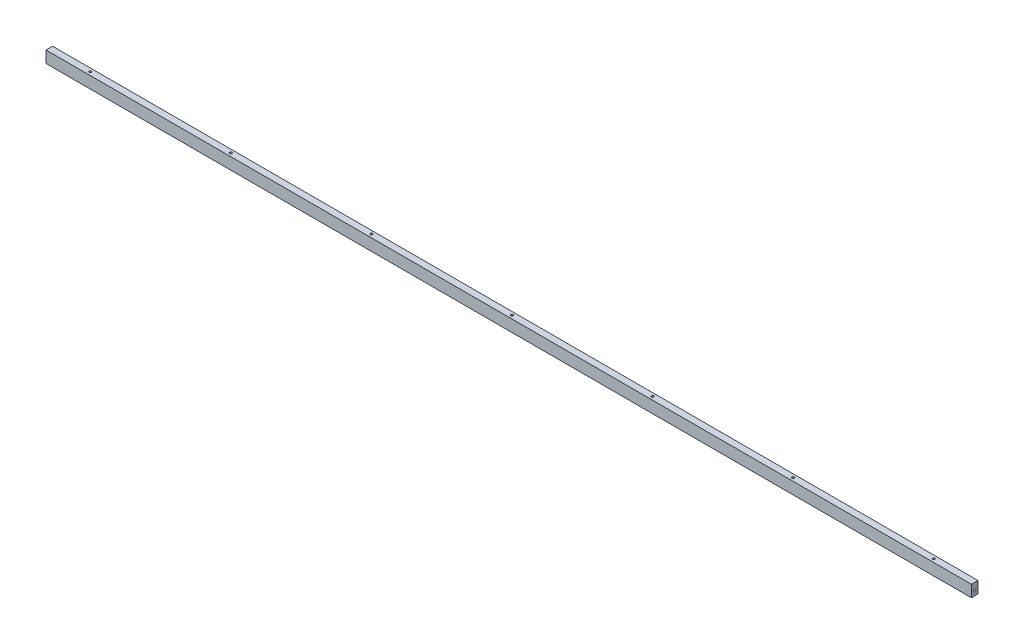
ISO-10303-21;
HEADER;
FILE_DESCRIPTION(('STEP AP214'),'2;1');
FILE_NAME('part.step','',(''),(''),'','','');
FILE_SCHEMA(('AUTOMOTIVE_DESIGN { 1 0 10303 214 1 1 1 1 }'));
ENDSEC;
DATA;
#1=APPLICATION_CONTEXT('core data for automotive mechanical design processes');
#2=APPLICATION_PROTOCOL_DEFINITION('international standard','automotive_design',2000,#1);
#3=PRODUCT_CONTEXT('',#1,'mechanical');
#4=PRODUCT('Part','Part','',(#3));
#5=PRODUCT_RELATED_PRODUCT_CATEGORY('part','',(#4));
#6=PRODUCT_DEFINITION_FORMATION('','',#4);
#7=PRODUCT_DEFINITION_CONTEXT('part definition',#1,'design');
#8=PRODUCT_DEFINITION('design','',#6,#7);
#9=PRODUCT_DEFINITION_SHAPE('','',#8);
#10=(LENGTH_UNIT() NAMED_UNIT(*) SI_UNIT(.MILLI.,.METRE.));
#11=(NAMED_UNIT(*) PLANE_ANGLE_UNIT() SI_UNIT($,.RADIAN.));
#12=(NAMED_UNIT(*) SI_UNIT($,.STERADIAN.) SOLID_ANGLE_UNIT());
#13=UNCERTAINTY_MEASURE_WITH_UNIT(LENGTH_MEASURE(1.E-05),#10,'distance_accuracy_value','');
#14=(GEOMETRIC_REPRESENTATION_CONTEXT(3) GLOBAL_UNCERTAINTY_ASSIGNED_CONTEXT((#13)) GLOBAL_UNIT_ASSIGNED_CONTEXT((#10,
#11,#12)) REPRESENTATION_CONTEXT('',''));
#15=CARTESIAN_POINT('',(0.,0.,0.));
#16=DIRECTION('',(0.,0.,1.));
#17=DIRECTION('',(1.,0.,0.));
#18=AXIS2_PLACEMENT_3D('',#15,#16,#17);
#19=CARTESIAN_POINT('',(987.499999999998,-12.5,7.));
#20=DIRECTION('',(-1.,0.,0.));
#21=DIRECTION('',(0.,0.,1.));
#22=AXIS2_PLACEMENT_3D('',#19,#20,#21);
#23=PLANE('',#22);
#24=CARTESIAN_POINT('',(987.499999999998,-2.50000000000004,0.));
#25=DIRECTION('',(1.,0.,0.));
#26=DIRECTION('',(0.,0.,-1.));
#27=AXIS2_PLACEMENT_3D('',#24,#25,#26);
#28=CIRCLE('',#27,2.49999999999999);
#29=CARTESIAN_POINT('',(987.499999999998,-2.50000000000004,-2.49999999999999));
#30=VERTEX_POINT('',#29);
#31=EDGE_CURVE('E135',#30,#30,#28,.T.);
#32=ORIENTED_EDGE('',*,*,#31,.F.);
#33=EDGE_LOOP('',(#32));
#34=FACE_BOUND('',#33,.T.);
#35=DIRECTION('',(0.,1.,0.));
#36=VECTOR('',#35,1.);
#37=CARTESIAN_POINT('',(987.499999999998,-12.5,-7.));
#38=LINE('',#37,#36);
#39=CARTESIAN_POINT('',(987.499999999998,-12.5,-7.));
#40=VERTEX_POINT('',#39);
#41=CARTESIAN_POINT('',(987.499999999998,12.5,-7.));
#42=VERTEX_POINT('',#41);
#43=EDGE_CURVE('E188',#40,#42,#38,.T.);
#44=ORIENTED_EDGE('',*,*,#43,.T.);
#45=DIRECTION('',(0.,0.,-1.));
#46=VECTOR('',#45,1.);
#47=CARTESIAN_POINT('',(987.499999999998,12.5,7.));
#48=LINE('',#47,#46);
#49=CARTESIAN_POINT('',(987.499999999998,12.5,7.));
#50=VERTEX_POINT('',#49);
#51=EDGE_CURVE('E13',#50,#42,#48,.T.);
#52=ORIENTED_EDGE('',*,*,#51,.F.);
#53=DIRECTION('',(0.,1.,0.));
#54=VECTOR('',#53,1.);
#55=CARTESIAN_POINT('',(987.499999999998,-12.5,7.));
#56=LINE('',#55,#54);
#57=CARTESIAN_POINT('',(987.499999999998,-12.5,7.));
#58=VERTEX_POINT('',#57);
#59=EDGE_CURVE('E189',#58,#50,#56,.T.);
#60=ORIENTED_EDGE('',*,*,#59,.F.);
#61=DIRECTION('',(0.,0.,-1.));
#62=VECTOR('',#61,1.);
#63=CARTESIAN_POINT('',(987.499999999998,-12.5,7.));
#64=LINE('',#63,#62);
#65=EDGE_CURVE('E195',#58,#40,#64,.T.);
#66=ORIENTED_EDGE('',*,*,#65,.T.);
#67=EDGE_LOOP('',(#44,#52,#60,#66));
#68=FACE_BOUND('',#67,.T.);
#69=ADVANCED_FACE('F50',(#34,#68),#23,.F.);
#70=CARTESIAN_POINT('',(-987.500000000003,12.5,7.));
#71=DIRECTION('',(0.,-1.,0.));
#72=DIRECTION('',(0.,0.,-1.));
#73=AXIS2_PLACEMENT_3D('',#70,#71,#72);
#74=PLANE('',#73);
#75=CARTESIAN_POINT('',(-900.,12.5,0.));
#76=DIRECTION('',(0.,1.,0.));
#77=DIRECTION('',(0.,0.,1.));
#78=AXIS2_PLACEMENT_3D('',#75,#76,#77);
#79=CIRCLE('',#78,2.49999999999995);
#80=CARTESIAN_POINT('',(-900.,12.5,2.50000000000001));
#81=VERTEX_POINT('',#80);
#82=EDGE_CURVE('E146',#81,#81,#79,.T.);
#83=ORIENTED_EDGE('',*,*,#82,.F.);
#84=EDGE_LOOP('',(#83));
#85=FACE_BOUND('',#84,.T.);
#86=CARTESIAN_POINT('',(-600.,12.5,0.));
#87=DIRECTION('',(0.,1.,0.));
#88=DIRECTION('',(0.,0.,1.));
#89=AXIS2_PLACEMENT_3D('',#86,#87,#88);
#90=CIRCLE('',#89,2.49999999999995);
#91=CARTESIAN_POINT('',(-600.,12.5,2.49999999999998));
#92=VERTEX_POINT('',#91);
#93=EDGE_CURVE('E152',#92,#92,#90,.T.);
#94=ORIENTED_EDGE('',*,*,#93,.F.);
#95=EDGE_LOOP('',(#94));
#96=FACE_BOUND('',#95,.T.);
#97=CARTESIAN_POINT('',(-300.,12.5,0.));
#98=DIRECTION('',(0.,1.,0.));
#99=DIRECTION('',(0.,0.,1.));
#100=AXIS2_PLACEMENT_3D('',#97,#98,#99);
#101=CIRCLE('',#100,2.5);
#102=CARTESIAN_POINT('',(-300.,12.5,2.50000000000001));
#103=VERTEX_POINT('',#102);
#104=EDGE_CURVE('E158',#103,#103,#101,.T.);
#105=ORIENTED_EDGE('',*,*,#104,.F.);
#106=EDGE_LOOP('',(#105));
#107=FACE_BOUND('',#106,.T.);
#108=CARTESIAN_POINT('',(899.999999999995,12.5,0.));
#109=DIRECTION('',(0.,1.,0.));
#110=DIRECTION('',(0.,0.,1.));
#111=AXIS2_PLACEMENT_3D('',#108,#109,#110);
#112=CIRCLE('',#111,2.49999999999995);
#113=CARTESIAN_POINT('',(899.999999999995,12.5,2.50000000000001));
#114=VERTEX_POINT('',#113);
#115=EDGE_CURVE('E164',#114,#114,#112,.T.);
#116=ORIENTED_EDGE('',*,*,#115,.F.);
#117=EDGE_LOOP('',(#116));
#118=FACE_BOUND('',#117,.T.);
#119=CARTESIAN_POINT('',(599.999999999996,12.5,0.));
#120=DIRECTION('',(0.,1.,0.));
#121=DIRECTION('',(0.,0.,1.));
#122=AXIS2_PLACEMENT_3D('',#119,#120,#121);
#123=CIRCLE('',#122,2.49999999999995);
#124=CARTESIAN_POINT('',(599.999999999996,12.5,2.49999999999998));
#125=VERTEX_POINT('',#124);
#126=EDGE_CURVE('E170',#125,#125,#123,.T.);
#127=ORIENTED_EDGE('',*,*,#126,.F.);
#128=EDGE_LOOP('',(#127));
#129=FACE_BOUND('',#128,.T.);
#130=CARTESIAN_POINT('',(299.999999999996,12.5,0.));
#131=DIRECTION('',(0.,1.,0.));
#132=DIRECTION('',(0.,0.,1.));
#133=AXIS2_PLACEMENT_3D('',#130,#131,#132);
#134=CIRCLE('',#133,2.5);
#135=CARTESIAN_POINT('',(299.999999999996,12.5,2.50000000000001));
#136=VERTEX_POINT('',#135);
#137=EDGE_CURVE('E176',#136,#136,#134,.T.);
#138=ORIENTED_EDGE('',*,*,#137,.F.);
#139=EDGE_LOOP('',(#138));
#140=FACE_BOUND('',#139,.T.);
#141=CARTESIAN_POINT('',(-2.22044604925031E-12,12.5,0.));
#142=DIRECTION('',(0.,1.,0.));
#143=DIRECTION('',(0.,0.,1.));
#144=AXIS2_PLACEMENT_3D('',#141,#142,#143);
#145=CIRCLE('',#144,2.49999999999999);
#146=CARTESIAN_POINT('',(-2.22044604925031E-12,12.5,2.49999999999999));
#147=VERTEX_POINT('',#146);
#148=EDGE_CURVE('E182',#147,#147,#145,.T.);
#149=ORIENTED_EDGE('',*,*,#148,.F.);
#150=EDGE_LOOP('',(#149));
#151=FACE_BOUND('',#150,.T.);
#152=DIRECTION('',(-1.,0.,0.));
#153=VECTOR('',#152,1.);
#154=CARTESIAN_POINT('',(-987.500000000003,12.5,-7.));
#155=LINE('',#154,#153);
#156=CARTESIAN_POINT('',(-987.500000000003,12.5,-7.));
#157=VERTEX_POINT('',#156);
#158=EDGE_CURVE('E198',#42,#157,#155,.T.);
#159=ORIENTED_EDGE('',*,*,#158,.T.);
#160=DIRECTION('',(0.,0.,-1.));
#161=VECTOR('',#160,1.);
#162=CARTESIAN_POINT('',(-987.500000000003,12.5,7.));
#163=LINE('',#162,#161);
#164=CARTESIAN_POINT('',(-987.500000000003,12.5,7.));
#165=VERTEX_POINT('',#164);
#166=EDGE_CURVE('E58',#165,#157,#163,.T.);
#167=ORIENTED_EDGE('',*,*,#166,.F.);
#168=DIRECTION('',(-1.,0.,0.));
#169=VECTOR('',#168,1.);
#170=CARTESIAN_POINT('',(-987.500000000003,12.5,7.));
#171=LINE('',#170,#169);
#172=EDGE_CURVE('E97',#50,#165,#171,.T.);
#173=ORIENTED_EDGE('',*,*,#172,.F.);
#174=ORIENTED_EDGE('',*,*,#51,.T.);
#175=EDGE_LOOP('',(#159,#167,#173,#174));
#176=FACE_BOUND('',#175,.T.);
#177=ADVANCED_FACE('F221',(#85,#96,#107,#118,#129,#140,#151,#176),#74,.F.);
#178=CARTESIAN_POINT('',(-987.500000000003,-12.5,7.));
#179=DIRECTION('',(1.,0.,0.));
#180=DIRECTION('',(0.,0.,-1.));
#181=AXIS2_PLACEMENT_3D('',#178,#179,#180);
#182=PLANE('',#181);
#183=CARTESIAN_POINT('',(-987.499999999998,-2.50000000000004,0.));
#184=DIRECTION('',(-1.,0.,0.));
#185=DIRECTION('',(0.,0.,1.));
#186=AXIS2_PLACEMENT_3D('',#183,#184,#185);
#187=CIRCLE('',#186,2.49999999999999);
#188=CARTESIAN_POINT('',(-987.499999999998,-2.50000000000004,2.49999999999999));
#189=VERTEX_POINT('',#188);
#190=EDGE_CURVE('E136',#189,#189,#187,.T.);
#191=ORIENTED_EDGE('',*,*,#190,.F.);
#192=EDGE_LOOP('',(#191));
#193=FACE_BOUND('',#192,.T.);
#194=DIRECTION('',(0.,-1.,0.));
#195=VECTOR('',#194,1.);
#196=CARTESIAN_POINT('',(-987.500000000003,-12.5,-7.));
#197=LINE('',#196,#195);
#198=CARTESIAN_POINT('',(-987.500000000003,-12.5,-7.));
#199=VERTEX_POINT('',#198);
#200=EDGE_CURVE('E84',#157,#199,#197,.T.);
#201=ORIENTED_EDGE('',*,*,#200,.T.);
#202=DIRECTION('',(0.,0.,-1.));
#203=VECTOR('',#202,1.);
#204=CARTESIAN_POINT('',(-987.500000000003,-12.5,7.));
#205=LINE('',#204,#203);
#206=CARTESIAN_POINT('',(-987.500000000003,-12.5,7.));
#207=VERTEX_POINT('',#206);
#208=EDGE_CURVE('E203',#207,#199,#205,.T.);
#209=ORIENTED_EDGE('',*,*,#208,.F.);
#210=DIRECTION('',(0.,-1.,0.));
#211=VECTOR('',#210,1.);
#212=CARTESIAN_POINT('',(-987.500000000003,-12.5,7.));
#213=LINE('',#212,#211);
#214=EDGE_CURVE('E192',#165,#207,#213,.T.);
#215=ORIENTED_EDGE('',*,*,#214,.F.);
#216=ORIENTED_EDGE('',*,*,#166,.T.);
#217=EDGE_LOOP('',(#201,#209,#215,#216));
#218=FACE_BOUND('',#217,.T.);
#219=ADVANCED_FACE('F205',(#193,#218),#182,.F.);
#220=CARTESIAN_POINT('',(-987.500000000003,-12.5,7.));
#221=DIRECTION('',(0.,1.,0.));
#222=DIRECTION('',(0.,0.,1.));
#223=AXIS2_PLACEMENT_3D('',#220,#221,#222);
#224=PLANE('',#223);
#225=DIRECTION('',(1.,0.,0.));
#226=VECTOR('',#225,1.);
#227=CARTESIAN_POINT('',(-987.500000000003,-12.5,-7.));
#228=LINE('',#227,#226);
#229=EDGE_CURVE('E90',#199,#40,#228,.T.);
#230=ORIENTED_EDGE('',*,*,#229,.T.);
#231=ORIENTED_EDGE('',*,*,#65,.F.);
#232=DIRECTION('',(1.,0.,0.));
#233=VECTOR('',#232,1.);
#234=CARTESIAN_POINT('',(-987.500000000003,-12.5,7.));
#235=LINE('',#234,#233);
#236=EDGE_CURVE('E66',#207,#58,#235,.T.);
#237=ORIENTED_EDGE('',*,*,#236,.F.);
#238=ORIENTED_EDGE('',*,*,#208,.T.);
#239=EDGE_LOOP('',(#230,#231,#237,#238));
#240=FACE_BOUND('',#239,.T.);
#241=ADVANCED_FACE('F212',(#240),#224,.F.);
#242=CARTESIAN_POINT('',(0.,0.,7.));
#243=DIRECTION('',(0.,0.,-1.));
#244=DIRECTION('',(-1.,0.,0.));
#245=AXIS2_PLACEMENT_3D('',#242,#243,#244);
#246=PLANE('',#245);
#247=ORIENTED_EDGE('',*,*,#59,.T.);
#248=ORIENTED_EDGE('',*,*,#172,.T.);
#249=ORIENTED_EDGE('',*,*,#214,.T.);
#250=ORIENTED_EDGE('',*,*,#236,.T.);
#251=EDGE_LOOP('',(#247,#248,#249,#250));
#252=FACE_BOUND('',#251,.T.);
#253=ADVANCED_FACE('F214',(#252),#246,.F.);
#254=CARTESIAN_POINT('',(0.,0.,-7.));
#255=DIRECTION('',(0.,0.,-1.));
#256=DIRECTION('',(-1.,0.,0.));
#257=AXIS2_PLACEMENT_3D('',#254,#255,#256);
#258=PLANE('',#257);
#259=ORIENTED_EDGE('',*,*,#43,.F.);
#260=ORIENTED_EDGE('',*,*,#229,.F.);
#261=ORIENTED_EDGE('',*,*,#200,.F.);
#262=ORIENTED_EDGE('',*,*,#158,.F.);
#263=EDGE_LOOP('',(#259,#260,#261,#262));
#264=FACE_BOUND('',#263,.T.);
#265=ADVANCED_FACE('F208',(#264),#258,.T.);
#266=CARTESIAN_POINT('',(-2.22044604925031E-12,-2.50000000000004,0.));
#267=DIRECTION('',(0.,1.,0.));
#268=DIRECTION('',(0.,0.,1.));
#269=AXIS2_PLACEMENT_3D('',#266,#267,#268);
#270=CONICAL_SURFACE('',#269,2.49999999999999,1.02974425867665);
#271=CARTESIAN_POINT('',(-2.22448791066467E-12,-4.00215154756894,0.));
#272=VERTEX_POINT('',#271);
#273=VERTEX_LOOP('',#272);
#274=FACE_BOUND('',#273,.T.);
#275=CARTESIAN_POINT('',(-2.22044604925031E-12,-2.50000000000004,0.));
#276=DIRECTION('',(0.,1.,0.));
#277=DIRECTION('',(0.,0.,1.));
#278=AXIS2_PLACEMENT_3D('',#275,#276,#277);
#279=CIRCLE('',#278,2.49999999999999);
#280=CARTESIAN_POINT('',(-2.22044604925031E-12,-2.50000000000004,2.49999999999999));
#281=VERTEX_POINT('',#280);
#282=EDGE_CURVE('E185',#281,#281,#279,.T.);
#283=ORIENTED_EDGE('',*,*,#282,.T.);
#284=EDGE_LOOP('',(#283));
#285=FACE_BOUND('',#284,.T.);
#286=ADVANCED_FACE('F296',(#274,#285),#270,.F.);
#287=CARTESIAN_POINT('',(-2.22044604925031E-12,12.5,0.));
#288=DIRECTION('',(0.,1.,0.));
#289=DIRECTION('',(0.,0.,1.));
#290=AXIS2_PLACEMENT_3D('',#287,#288,#289);
#291=CYLINDRICAL_SURFACE('',#290,2.49999999999999);
#292=ORIENTED_EDGE('',*,*,#282,.F.);
#293=EDGE_LOOP('',(#292));
#294=FACE_BOUND('',#293,.T.);
#295=ORIENTED_EDGE('',*,*,#148,.T.);
#296=EDGE_LOOP('',(#295));
#297=FACE_BOUND('',#296,.T.);
#298=ADVANCED_FACE('F292',(#294,#297),#291,.F.);
#299=CARTESIAN_POINT('',(299.999999999996,-2.50000000000004,0.));
#300=DIRECTION('',(0.,1.,0.));
#301=DIRECTION('',(0.,0.,1.));
#302=AXIS2_PLACEMENT_3D('',#299,#300,#301);
#303=CONICAL_SURFACE('',#302,2.5,1.02974425867666);
#304=CARTESIAN_POINT('',(299.999999999996,-4.00215154756894,0.));
#305=VERTEX_POINT('',#304);
#306=VERTEX_LOOP('',#305);
#307=FACE_BOUND('',#306,.T.);
#308=CARTESIAN_POINT('',(299.999999999996,-2.50000000000004,0.));
#309=DIRECTION('',(0.,1.,0.));
#310=DIRECTION('',(0.,0.,1.));
#311=AXIS2_PLACEMENT_3D('',#308,#309,#310);
#312=CIRCLE('',#311,2.5);
#313=CARTESIAN_POINT('',(299.999999999996,-2.50000000000004,2.50000000000001));
#314=VERTEX_POINT('',#313);
#315=EDGE_CURVE('E179',#314,#314,#312,.T.);
#316=ORIENTED_EDGE('',*,*,#315,.T.);
#317=EDGE_LOOP('',(#316));
#318=FACE_BOUND('',#317,.T.);
#319=ADVANCED_FACE('F288',(#307,#318),#303,.F.);
#320=CARTESIAN_POINT('',(299.999999999996,12.5,0.));
#321=DIRECTION('',(0.,1.,0.));
#322=DIRECTION('',(0.,0.,1.));
#323=AXIS2_PLACEMENT_3D('',#320,#321,#322);
#324=CYLINDRICAL_SURFACE('',#323,2.5);
#325=ORIENTED_EDGE('',*,*,#315,.F.);
#326=EDGE_LOOP('',(#325));
#327=FACE_BOUND('',#326,.T.);
#328=ORIENTED_EDGE('',*,*,#137,.T.);
#329=EDGE_LOOP('',(#328));
#330=FACE_BOUND('',#329,.T.);
#331=ADVANCED_FACE('F284',(#327,#330),#324,.F.);
#332=CARTESIAN_POINT('',(599.999999999996,-2.50000000000004,0.));
#333=DIRECTION('',(0.,1.,0.));
#334=DIRECTION('',(0.,0.,1.));
#335=AXIS2_PLACEMENT_3D('',#332,#333,#334);
#336=CONICAL_SURFACE('',#335,2.49999999999995,1.02974425867665);
#337=CARTESIAN_POINT('',(599.999999999996,-4.00215154756894,0.));
#338=VERTEX_POINT('',#337);
#339=VERTEX_LOOP('',#338);
#340=FACE_BOUND('',#339,.T.);
#341=CARTESIAN_POINT('',(599.999999999996,-2.50000000000004,0.));
#342=DIRECTION('',(0.,1.,0.));
#343=DIRECTION('',(0.,0.,1.));
#344=AXIS2_PLACEMENT_3D('',#341,#342,#343);
#345=CIRCLE('',#344,2.49999999999995);
#346=CARTESIAN_POINT('',(599.999999999996,-2.50000000000004,2.49999999999998));
#347=VERTEX_POINT('',#346);
#348=EDGE_CURVE('E173',#347,#347,#345,.T.);
#349=ORIENTED_EDGE('',*,*,#348,.T.);
#350=EDGE_LOOP('',(#349));
#351=FACE_BOUND('',#350,.T.);
#352=ADVANCED_FACE('F280',(#340,#351),#336,.F.);
#353=CARTESIAN_POINT('',(599.999999999996,12.5,0.));
#354=DIRECTION('',(0.,1.,0.));
#355=DIRECTION('',(0.,0.,1.));
#356=AXIS2_PLACEMENT_3D('',#353,#354,#355);
#357=CYLINDRICAL_SURFACE('',#356,2.49999999999995);
#358=ORIENTED_EDGE('',*,*,#348,.F.);
#359=EDGE_LOOP('',(#358));
#360=FACE_BOUND('',#359,.T.);
#361=ORIENTED_EDGE('',*,*,#126,.T.);
#362=EDGE_LOOP('',(#361));
#363=FACE_BOUND('',#362,.T.);
#364=ADVANCED_FACE('F276',(#360,#363),#357,.F.);
#365=CARTESIAN_POINT('',(899.999999999995,-2.50000000000004,0.));
#366=DIRECTION('',(0.,1.,0.));
#367=DIRECTION('',(0.,0.,1.));
#368=AXIS2_PLACEMENT_3D('',#365,#366,#367);
#369=CONICAL_SURFACE('',#368,2.49999999999995,1.02974425867665);
#370=CARTESIAN_POINT('',(899.999999999995,-4.00215154756894,0.));
#371=VERTEX_POINT('',#370);
#372=VERTEX_LOOP('',#371);
#373=FACE_BOUND('',#372,.T.);
#374=CARTESIAN_POINT('',(899.999999999995,-2.50000000000004,0.));
#375=DIRECTION('',(0.,1.,0.));
#376=DIRECTION('',(0.,0.,1.));
#377=AXIS2_PLACEMENT_3D('',#374,#375,#376);
#378=CIRCLE('',#377,2.49999999999995);
#379=CARTESIAN_POINT('',(899.999999999995,-2.50000000000004,2.50000000000001));
#380=VERTEX_POINT('',#379);
#381=EDGE_CURVE('E167',#380,#380,#378,.T.);
#382=ORIENTED_EDGE('',*,*,#381,.T.);
#383=EDGE_LOOP('',(#382));
#384=FACE_BOUND('',#383,.T.);
#385=ADVANCED_FACE('F272',(#373,#384),#369,.F.);
#386=CARTESIAN_POINT('',(899.999999999995,12.5,0.));
#387=DIRECTION('',(0.,1.,0.));
#388=DIRECTION('',(0.,0.,1.));
#389=AXIS2_PLACEMENT_3D('',#386,#387,#388);
#390=CYLINDRICAL_SURFACE('',#389,2.49999999999995);
#391=ORIENTED_EDGE('',*,*,#381,.F.);
#392=EDGE_LOOP('',(#391));
#393=FACE_BOUND('',#392,.T.);
#394=ORIENTED_EDGE('',*,*,#115,.T.);
#395=EDGE_LOOP('',(#394));
#396=FACE_BOUND('',#395,.T.);
#397=ADVANCED_FACE('F268',(#393,#396),#390,.F.);
#398=CARTESIAN_POINT('',(-300.,-2.50000000000004,0.));
#399=DIRECTION('',(0.,1.,0.));
#400=DIRECTION('',(0.,0.,1.));
#401=AXIS2_PLACEMENT_3D('',#398,#399,#400);
#402=CONICAL_SURFACE('',#401,2.5,1.02974425867666);
#403=CARTESIAN_POINT('',(-300.,-4.00215154756894,0.));
#404=VERTEX_POINT('',#403);
#405=VERTEX_LOOP('',#404);
#406=FACE_BOUND('',#405,.T.);
#407=CARTESIAN_POINT('',(-300.,-2.50000000000004,0.));
#408=DIRECTION('',(0.,1.,0.));
#409=DIRECTION('',(0.,0.,1.));
#410=AXIS2_PLACEMENT_3D('',#407,#408,#409);
#411=CIRCLE('',#410,2.5);
#412=CARTESIAN_POINT('',(-300.,-2.50000000000004,2.50000000000001));
#413=VERTEX_POINT('',#412);
#414=EDGE_CURVE('E161',#413,#413,#411,.T.);
#415=ORIENTED_EDGE('',*,*,#414,.T.);
#416=EDGE_LOOP('',(#415));
#417=FACE_BOUND('',#416,.T.);
#418=ADVANCED_FACE('F264',(#406,#417),#402,.F.);
#419=CARTESIAN_POINT('',(-300.,12.5,0.));
#420=DIRECTION('',(0.,1.,0.));
#421=DIRECTION('',(0.,0.,1.));
#422=AXIS2_PLACEMENT_3D('',#419,#420,#421);
#423=CYLINDRICAL_SURFACE('',#422,2.5);
#424=ORIENTED_EDGE('',*,*,#414,.F.);
#425=EDGE_LOOP('',(#424));
#426=FACE_BOUND('',#425,.T.);
#427=ORIENTED_EDGE('',*,*,#104,.T.);
#428=EDGE_LOOP('',(#427));
#429=FACE_BOUND('',#428,.T.);
#430=ADVANCED_FACE('F260',(#426,#429),#423,.F.);
#431=CARTESIAN_POINT('',(-600.,-2.50000000000004,0.));
#432=DIRECTION('',(0.,1.,0.));
#433=DIRECTION('',(0.,0.,1.));
#434=AXIS2_PLACEMENT_3D('',#431,#432,#433);
#435=CONICAL_SURFACE('',#434,2.49999999999995,1.02974425867665);
#436=CARTESIAN_POINT('',(-600.,-4.00215154756894,0.));
#437=VERTEX_POINT('',#436);
#438=VERTEX_LOOP('',#437);
#439=FACE_BOUND('',#438,.T.);
#440=CARTESIAN_POINT('',(-600.,-2.50000000000004,0.));
#441=DIRECTION('',(0.,1.,0.));
#442=DIRECTION('',(0.,0.,1.));
#443=AXIS2_PLACEMENT_3D('',#440,#441,#442);
#444=CIRCLE('',#443,2.49999999999995);
#445=CARTESIAN_POINT('',(-600.,-2.50000000000004,2.49999999999998));
#446=VERTEX_POINT('',#445);
#447=EDGE_CURVE('E155',#446,#446,#444,.T.);
#448=ORIENTED_EDGE('',*,*,#447,.T.);
#449=EDGE_LOOP('',(#448));
#450=FACE_BOUND('',#449,.T.);
#451=ADVANCED_FACE('F256',(#439,#450),#435,.F.);
#452=CARTESIAN_POINT('',(-600.,12.5,0.));
#453=DIRECTION('',(0.,1.,0.));
#454=DIRECTION('',(0.,0.,1.));
#455=AXIS2_PLACEMENT_3D('',#452,#453,#454);
#456=CYLINDRICAL_SURFACE('',#455,2.49999999999995);
#457=ORIENTED_EDGE('',*,*,#447,.F.);
#458=EDGE_LOOP('',(#457));
#459=FACE_BOUND('',#458,.T.);
#460=ORIENTED_EDGE('',*,*,#93,.T.);
#461=EDGE_LOOP('',(#460));
#462=FACE_BOUND('',#461,.T.);
#463=ADVANCED_FACE('F252',(#459,#462),#456,.F.);
#464=CARTESIAN_POINT('',(-900.,-2.50000000000004,0.));
#465=DIRECTION('',(0.,1.,0.));
#466=DIRECTION('',(0.,0.,1.));
#467=AXIS2_PLACEMENT_3D('',#464,#465,#466);
#468=CONICAL_SURFACE('',#467,2.49999999999995,1.02974425867665);
#469=CARTESIAN_POINT('',(-900.,-4.00215154756894,0.));
#470=VERTEX_POINT('',#469);
#471=VERTEX_LOOP('',#470);
#472=FACE_BOUND('',#471,.T.);
#473=CARTESIAN_POINT('',(-900.,-2.50000000000004,0.));
#474=DIRECTION('',(0.,1.,0.));
#475=DIRECTION('',(0.,0.,1.));
#476=AXIS2_PLACEMENT_3D('',#473,#474,#475);
#477=CIRCLE('',#476,2.49999999999995);
#478=CARTESIAN_POINT('',(-900.,-2.50000000000004,2.50000000000001));
#479=VERTEX_POINT('',#478);
#480=EDGE_CURVE('E149',#479,#479,#477,.T.);
#481=ORIENTED_EDGE('',*,*,#480,.T.);
#482=EDGE_LOOP('',(#481));
#483=FACE_BOUND('',#482,.T.);
#484=ADVANCED_FACE('F248',(#472,#483),#468,.F.);
#485=CARTESIAN_POINT('',(-900.,12.5,0.));
#486=DIRECTION('',(0.,1.,0.));
#487=DIRECTION('',(0.,0.,1.));
#488=AXIS2_PLACEMENT_3D('',#485,#486,#487);
#489=CYLINDRICAL_SURFACE('',#488,2.49999999999995);
#490=ORIENTED_EDGE('',*,*,#480,.F.);
#491=EDGE_LOOP('',(#490));
#492=FACE_BOUND('',#491,.T.);
#493=ORIENTED_EDGE('',*,*,#82,.T.);
#494=EDGE_LOOP('',(#493));
#495=FACE_BOUND('',#494,.T.);
#496=ADVANCED_FACE('F240',(#492,#495),#489,.F.);
#497=CARTESIAN_POINT('',(972.499999999998,-2.50000000000004,0.));
#498=DIRECTION('',(1.,0.,0.));
#499=DIRECTION('',(0.,0.,-1.));
#500=AXIS2_PLACEMENT_3D('',#497,#498,#499);
#501=CONICAL_SURFACE('',#500,2.49999999999999,1.02974425867664);
#502=CARTESIAN_POINT('',(970.997848452429,-2.50000000000005,0.));
#503=VERTEX_POINT('',#502);
#504=VERTEX_LOOP('',#503);
#505=FACE_BOUND('',#504,.T.);
#506=CARTESIAN_POINT('',(972.499999999998,-2.50000000000004,0.));
#507=DIRECTION('',(1.,0.,0.));
#508=DIRECTION('',(0.,0.,-1.));
#509=AXIS2_PLACEMENT_3D('',#506,#507,#508);
#510=CIRCLE('',#509,2.49999999999999);
#511=CARTESIAN_POINT('',(972.499999999998,-2.50000000000004,-2.49999999999999));
#512=VERTEX_POINT('',#511);
#513=EDGE_CURVE('E139',#512,#512,#510,.T.);
#514=ORIENTED_EDGE('',*,*,#513,.T.);
#515=EDGE_LOOP('',(#514));
#516=FACE_BOUND('',#515,.T.);
#517=ADVANCED_FACE('F234',(#505,#516),#501,.F.);
#518=CARTESIAN_POINT('',(987.499999999998,-2.50000000000004,0.));
#519=DIRECTION('',(1.,0.,0.));
#520=DIRECTION('',(0.,0.,-1.));
#521=AXIS2_PLACEMENT_3D('',#518,#519,#520);
#522=CYLINDRICAL_SURFACE('',#521,2.49999999999999);
#523=ORIENTED_EDGE('',*,*,#513,.F.);
#524=EDGE_LOOP('',(#523));
#525=FACE_BOUND('',#524,.T.);
#526=ORIENTED_EDGE('',*,*,#31,.T.);
#527=EDGE_LOOP('',(#526));
#528=FACE_BOUND('',#527,.T.);
#529=ADVANCED_FACE('F129',(#525,#528),#522,.F.);
#530=CARTESIAN_POINT('',(-972.499999999998,-2.50000000000004,0.));
#531=DIRECTION('',(-1.,0.,0.));
#532=DIRECTION('',(0.,0.,1.));
#533=AXIS2_PLACEMENT_3D('',#530,#531,#532);
#534=CONICAL_SURFACE('',#533,2.49999999999999,1.02974425867664);
#535=CARTESIAN_POINT('',(-970.997848452429,-2.50000000000005,0.));
#536=VERTEX_POINT('',#535);
#537=VERTEX_LOOP('',#536);
#538=FACE_BOUND('',#537,.T.);
#539=CARTESIAN_POINT('',(-972.499999999998,-2.50000000000004,0.));
#540=DIRECTION('',(-1.,0.,0.));
#541=DIRECTION('',(0.,0.,1.));
#542=AXIS2_PLACEMENT_3D('',#539,#540,#541);
#543=CIRCLE('',#542,2.49999999999999);
#544=CARTESIAN_POINT('',(-972.499999999998,-2.50000000000004,2.49999999999999));
#545=VERTEX_POINT('',#544);
#546=EDGE_CURVE('E133',#545,#545,#543,.T.);
#547=ORIENTED_EDGE('',*,*,#546,.T.);
#548=EDGE_LOOP('',(#547));
#549=FACE_BOUND('',#548,.T.);
#550=ADVANCED_FACE('F125',(#538,#549),#534,.F.);
#551=CARTESIAN_POINT('',(-987.499999999998,-2.50000000000004,0.));
#552=DIRECTION('',(-1.,0.,0.));
#553=DIRECTION('',(0.,0.,1.));
#554=AXIS2_PLACEMENT_3D('',#551,#552,#553);
#555=CYLINDRICAL_SURFACE('',#554,2.49999999999999);
#556=ORIENTED_EDGE('',*,*,#546,.F.);
#557=EDGE_LOOP('',(#556));
#558=FACE_BOUND('',#557,.T.);
#559=ORIENTED_EDGE('',*,*,#190,.T.);
#560=EDGE_LOOP('',(#559));
#561=FACE_BOUND('',#560,.T.);
#562=ADVANCED_FACE('F128',(#558,#561),#555,.F.);
#563=CLOSED_SHELL('',(#69,#177,#219,#241,#253,#265,#286,#298,#319,#331,#352,#364,#385,#397,#418,
#430,#451,#463,#484,#496,#517,#529,#550,#562));
#564=MANIFOLD_SOLID_BREP('B2',#563);
#565=ADVANCED_BREP_SHAPE_REPRESENTATION('',(#18,#564),#14);
#566=SHAPE_DEFINITION_REPRESENTATION(#9,#565);
ENDSEC;
END-ISO-10303-21;
